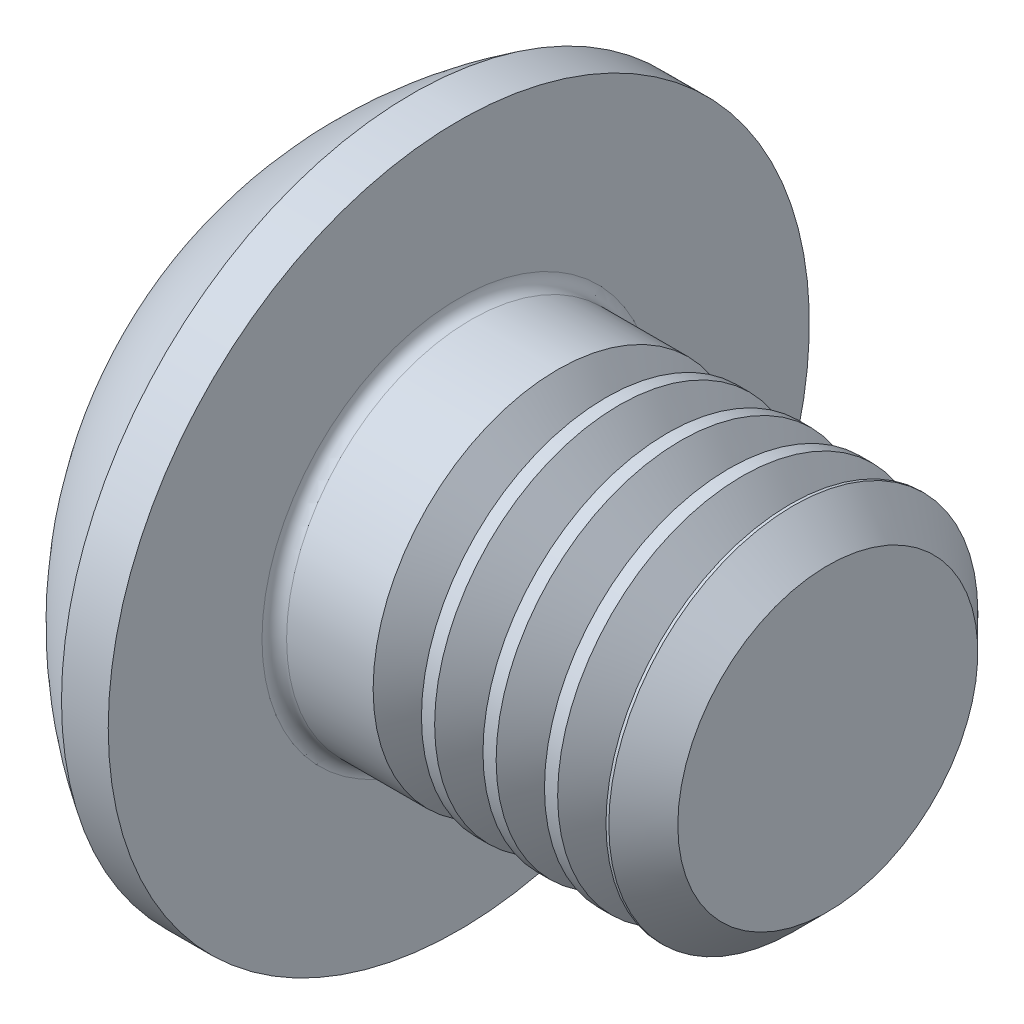
ISO-10303-21;
HEADER;
FILE_DESCRIPTION(('STEP AP214'),'2;1');
FILE_NAME('part.step','',(''),(''),'','','');
FILE_SCHEMA(('AUTOMOTIVE_DESIGN { 1 0 10303 214 1 1 1 1 }'));
ENDSEC;
DATA;
#1=APPLICATION_CONTEXT('core data for automotive mechanical design processes');
#2=APPLICATION_PROTOCOL_DEFINITION('international standard','automotive_design',2000,#1);
#3=PRODUCT_CONTEXT('',#1,'mechanical');
#4=PRODUCT('Part','Part','',(#3));
#5=PRODUCT_RELATED_PRODUCT_CATEGORY('part','',(#4));
#6=PRODUCT_DEFINITION_FORMATION('','',#4);
#7=PRODUCT_DEFINITION_CONTEXT('part definition',#1,'design');
#8=PRODUCT_DEFINITION('design','',#6,#7);
#9=PRODUCT_DEFINITION_SHAPE('','',#8);
#10=(LENGTH_UNIT() NAMED_UNIT(*) SI_UNIT(.MILLI.,.METRE.));
#11=(NAMED_UNIT(*) PLANE_ANGLE_UNIT() SI_UNIT($,.RADIAN.));
#12=(NAMED_UNIT(*) SI_UNIT($,.STERADIAN.) SOLID_ANGLE_UNIT());
#13=UNCERTAINTY_MEASURE_WITH_UNIT(LENGTH_MEASURE(1.E-05),#10,'distance_accuracy_value','');
#14=(GEOMETRIC_REPRESENTATION_CONTEXT(3) GLOBAL_UNCERTAINTY_ASSIGNED_CONTEXT((#13)) GLOBAL_UNIT_ASSIGNED_CONTEXT((#10,
#11,#12)) REPRESENTATION_CONTEXT('',''));
#15=CARTESIAN_POINT('',(0.,0.,0.));
#16=DIRECTION('',(0.,0.,1.));
#17=DIRECTION('',(1.,0.,0.));
#18=AXIS2_PLACEMENT_3D('',#15,#16,#17);
#19=CARTESIAN_POINT('',(0.,0.,0.));
#20=DIRECTION('',(-1.,0.,0.));
#21=DIRECTION('',(0.,0.,1.));
#22=AXIS2_PLACEMENT_3D('',#19,#20,#21);
#23=PLANE('',#22);
#24=CARTESIAN_POINT('',(0.,0.,0.));
#25=DIRECTION('',(-1.,0.,0.));
#26=DIRECTION('',(0.,0.,1.));
#27=AXIS2_PLACEMENT_3D('',#24,#25,#26);
#28=CIRCLE('',#27,1.425);
#29=CARTESIAN_POINT('',(0.,0.,1.425));
#30=VERTEX_POINT('',#29);
#31=EDGE_CURVE('E153',#30,#30,#28,.T.);
#32=ORIENTED_EDGE('',*,*,#31,.T.);
#33=EDGE_LOOP('',(#32));
#34=FACE_BOUND('',#33,.T.);
#35=DIRECTION('',(0.,-1.,0.));
#36=VECTOR('',#35,1.);
#37=CARTESIAN_POINT('',(0.,-0.577350269189625,0.999999999999998));
#38=LINE('',#37,#36);
#39=CARTESIAN_POINT('',(0.,0.577350269189628,1.));
#40=VERTEX_POINT('',#39);
#41=CARTESIAN_POINT('',(0.,-0.577350269189625,0.999999999999998));
#42=VERTEX_POINT('',#41);
#43=EDGE_CURVE('E48',#40,#42,#38,.T.);
#44=ORIENTED_EDGE('',*,*,#43,.T.);
#45=DIRECTION('',(0.,-0.499999999999999,-0.866025403784439));
#46=VECTOR('',#45,1.);
#47=CARTESIAN_POINT('',(0.,-1.15470053837925,0.));
#48=LINE('',#47,#46);
#49=CARTESIAN_POINT('',(0.,-1.15470053837925,0.));
#50=VERTEX_POINT('',#49);
#51=EDGE_CURVE('E298',#42,#50,#48,.T.);
#52=ORIENTED_EDGE('',*,*,#51,.T.);
#53=DIRECTION('',(0.,0.499999999999997,-0.86602540378444));
#54=VECTOR('',#53,1.);
#55=CARTESIAN_POINT('',(0.,-0.577350269189626,-1.));
#56=LINE('',#55,#54);
#57=CARTESIAN_POINT('',(0.,-0.577350269189626,-1.));
#58=VERTEX_POINT('',#57);
#59=EDGE_CURVE('E128',#50,#58,#56,.T.);
#60=ORIENTED_EDGE('',*,*,#59,.T.);
#61=DIRECTION('',(0.,1.,0.));
#62=VECTOR('',#61,1.);
#63=CARTESIAN_POINT('',(0.,0.577350269189628,-1.));
#64=LINE('',#63,#62);
#65=CARTESIAN_POINT('',(0.,0.577350269189628,-1.));
#66=VERTEX_POINT('',#65);
#67=EDGE_CURVE('E318',#58,#66,#64,.T.);
#68=ORIENTED_EDGE('',*,*,#67,.T.);
#69=DIRECTION('',(0.,0.499999999999999,0.866025403784439));
#70=VECTOR('',#69,1.);
#71=CARTESIAN_POINT('',(0.,1.15470053837925,0.));
#72=LINE('',#71,#70);
#73=CARTESIAN_POINT('',(0.,1.15470053837925,0.));
#74=VERTEX_POINT('',#73);
#75=EDGE_CURVE('E320',#66,#74,#72,.T.);
#76=ORIENTED_EDGE('',*,*,#75,.T.);
#77=DIRECTION('',(0.,-0.499999999999998,0.866025403784439));
#78=VECTOR('',#77,1.);
#79=CARTESIAN_POINT('',(0.,0.577350269189628,1.));
#80=LINE('',#79,#78);
#81=EDGE_CURVE('E322',#74,#40,#80,.T.);
#82=ORIENTED_EDGE('',*,*,#81,.T.);
#83=EDGE_LOOP('',(#44,#52,#60,#68,#76,#82));
#84=FACE_BOUND('',#83,.T.);
#85=ADVANCED_FACE('F33',(#34,#84),#23,.T.);
#86=CARTESIAN_POINT('',(3.03337598425198,0.,0.));
#87=DIRECTION('',(-1.,0.,0.));
#88=DIRECTION('',(0.,1.,0.));
#89=AXIS2_PLACEMENT_3D('',#86,#87,#88);
#90=SPHERICAL_SURFACE('',#89,3.35141684393879);
#91=CARTESIAN_POINT('',(1.27,0.,0.));
#92=DIRECTION('',(-1.,0.,0.));
#93=DIRECTION('',(0.,0.,1.));
#94=AXIS2_PLACEMENT_3D('',#91,#92,#93);
#95=CIRCLE('',#94,2.85);
#96=CARTESIAN_POINT('',(1.27,0.,2.85));
#97=VERTEX_POINT('',#96);
#98=EDGE_CURVE('E150',#97,#97,#95,.T.);
#99=ORIENTED_EDGE('',*,*,#98,.T.);
#100=EDGE_LOOP('',(#99));
#101=FACE_BOUND('',#100,.T.);
#102=ORIENTED_EDGE('',*,*,#31,.F.);
#103=EDGE_LOOP('',(#102));
#104=FACE_BOUND('',#103,.T.);
#105=ADVANCED_FACE('F175',(#101,#104),#90,.T.);
#106=CARTESIAN_POINT('',(0.,0.,0.));
#107=DIRECTION('',(-1.,0.,0.));
#108=DIRECTION('',(0.,0.,1.));
#109=AXIS2_PLACEMENT_3D('',#106,#107,#108);
#110=CYLINDRICAL_SURFACE('',#109,2.85);
#111=ORIENTED_EDGE('',*,*,#98,.F.);
#112=EDGE_LOOP('',(#111));
#113=FACE_BOUND('',#112,.T.);
#114=CARTESIAN_POINT('',(1.65,0.,0.));
#115=DIRECTION('',(-1.,0.,0.));
#116=DIRECTION('',(0.,0.,1.));
#117=AXIS2_PLACEMENT_3D('',#114,#115,#116);
#118=CIRCLE('',#117,2.85);
#119=CARTESIAN_POINT('',(1.65,0.,2.85));
#120=VERTEX_POINT('',#119);
#121=EDGE_CURVE('E147',#120,#120,#118,.T.);
#122=ORIENTED_EDGE('',*,*,#121,.T.);
#123=EDGE_LOOP('',(#122));
#124=FACE_BOUND('',#123,.T.);
#125=ADVANCED_FACE('F180',(#113,#124),#110,.T.);
#126=CARTESIAN_POINT('',(1.65,1.49999999999999,0.));
#127=DIRECTION('',(-1.,0.,0.));
#128=DIRECTION('',(0.,0.,1.));
#129=AXIS2_PLACEMENT_3D('',#126,#127,#128);
#130=PLANE('',#129);
#131=CARTESIAN_POINT('',(1.65,0.,0.));
#132=DIRECTION('',(-1.,0.,0.));
#133=DIRECTION('',(0.,0.,1.));
#134=AXIS2_PLACEMENT_3D('',#131,#132,#133);
#135=CIRCLE('',#134,1.6);
#136=CARTESIAN_POINT('',(1.65,0.,1.6));
#137=VERTEX_POINT('',#136);
#138=EDGE_CURVE('E41',#137,#137,#135,.T.);
#139=ORIENTED_EDGE('',*,*,#138,.T.);
#140=EDGE_LOOP('',(#139));
#141=FACE_BOUND('',#140,.T.);
#142=ORIENTED_EDGE('',*,*,#121,.F.);
#143=EDGE_LOOP('',(#142));
#144=FACE_BOUND('',#143,.T.);
#145=ADVANCED_FACE('F158',(#141,#144),#130,.F.);
#146=CARTESIAN_POINT('',(0.,0.,0.));
#147=DIRECTION('',(-1.,0.,0.));
#148=DIRECTION('',(0.,0.,1.));
#149=AXIS2_PLACEMENT_3D('',#146,#147,#148);
#150=CYLINDRICAL_SURFACE('',#149,1.5);
#151=CARTESIAN_POINT('',(2.45359178553217,0.,0.));
#152=DIRECTION('',(-1.,0.,0.));
#153=DIRECTION('',(0.,-1.,0.));
#154=AXIS2_PLACEMENT_3D('',#151,#152,#153);
#155=CIRCLE('',#154,1.5);
#156=CARTESIAN_POINT('',(2.45359178553217,-1.5,0.));
#157=VERTEX_POINT('',#156);
#158=EDGE_CURVE('E293',#157,#157,#155,.T.);
#159=ORIENTED_EDGE('',*,*,#158,.T.);
#160=EDGE_LOOP('',(#159));
#161=FACE_BOUND('',#160,.T.);
#162=CARTESIAN_POINT('',(1.75,0.,0.));
#163=DIRECTION('',(-1.,0.,0.));
#164=DIRECTION('',(0.,0.,1.));
#165=AXIS2_PLACEMENT_3D('',#162,#163,#164);
#166=CIRCLE('',#165,1.5);
#167=CARTESIAN_POINT('',(1.75,0.,1.5));
#168=VERTEX_POINT('',#167);
#169=EDGE_CURVE('E11',#168,#168,#166,.F.);
#170=ORIENTED_EDGE('',*,*,#169,.T.);
#171=EDGE_LOOP('',(#170));
#172=FACE_BOUND('',#171,.T.);
#173=ADVANCED_FACE('F162',(#161,#172),#150,.T.);
#174=CARTESIAN_POINT('',(1.75,0.,0.));
#175=DIRECTION('',(-1.,0.,0.));
#176=DIRECTION('',(0.,0.,1.));
#177=AXIS2_PLACEMENT_3D('',#174,#175,#176);
#178=TOROIDAL_SURFACE('',#177,1.6,0.1);
#179=ORIENTED_EDGE('',*,*,#169,.F.);
#180=EDGE_LOOP('',(#179));
#181=FACE_BOUND('',#180,.T.);
#182=ORIENTED_EDGE('',*,*,#138,.F.);
#183=EDGE_LOOP('',(#182));
#184=FACE_BOUND('',#183,.T.);
#185=ADVANCED_FACE('F35',(#181,#184),#178,.F.);
#186=CARTESIAN_POINT('',(1.04,-1.15470053837925,0.));
#187=DIRECTION('',(0.,0.866025403784439,-0.499999999999999));
#188=DIRECTION('',(0.,0.499999999999999,0.866025403784439));
#189=AXIS2_PLACEMENT_3D('',#186,#187,#188);
#190=PLANE('',#189);
#191=DIRECTION('',(0.,-0.499999999999999,-0.866025403784439));
#192=VECTOR('',#191,1.);
#193=CARTESIAN_POINT('',(1.04,-1.15470053837925,0.));
#194=LINE('',#193,#192);
#195=CARTESIAN_POINT('',(1.04,-0.577350269189625,0.999999999999998));
#196=VERTEX_POINT('',#195);
#197=CARTESIAN_POINT('',(1.04,-0.866025403784437,0.499999999999998));
#198=VERTEX_POINT('',#197);
#199=EDGE_CURVE('E114',#196,#198,#194,.T.);
#200=ORIENTED_EDGE('',*,*,#199,.T.);
#201=CARTESIAN_POINT('',(1.04,-1.15470053837925,0.));
#202=VERTEX_POINT('',#201);
#203=EDGE_CURVE('E109',#198,#202,#194,.T.);
#204=ORIENTED_EDGE('',*,*,#203,.T.);
#205=DIRECTION('',(-1.,0.,0.));
#206=VECTOR('',#205,1.);
#207=CARTESIAN_POINT('',(1.04,-1.15470053837925,0.));
#208=LINE('',#207,#206);
#209=EDGE_CURVE('E111',#202,#50,#208,.T.);
#210=ORIENTED_EDGE('',*,*,#209,.T.);
#211=ORIENTED_EDGE('',*,*,#51,.F.);
#212=DIRECTION('',(-1.,0.,0.));
#213=VECTOR('',#212,1.);
#214=CARTESIAN_POINT('',(1.04,-0.577350269189625,0.999999999999998));
#215=LINE('',#214,#213);
#216=EDGE_CURVE('E315',#196,#42,#215,.T.);
#217=ORIENTED_EDGE('',*,*,#216,.F.);
#218=EDGE_LOOP('',(#200,#204,#210,#211,#217));
#219=FACE_BOUND('',#218,.T.);
#220=ADVANCED_FACE('F110',(#219),#190,.T.);
#221=CARTESIAN_POINT('',(1.04,-0.577350269189626,-1.));
#222=DIRECTION('',(0.,0.86602540378444,0.499999999999998));
#223=DIRECTION('',(0.,-0.499999999999998,0.86602540378444));
#224=AXIS2_PLACEMENT_3D('',#221,#222,#223);
#225=PLANE('',#224);
#226=DIRECTION('',(0.,0.499999999999997,-0.86602540378444));
#227=VECTOR('',#226,1.);
#228=CARTESIAN_POINT('',(1.04,-0.577350269189626,-1.));
#229=LINE('',#228,#227);
#230=CARTESIAN_POINT('',(1.04,-0.86602540378444,-0.499999999999997));
#231=VERTEX_POINT('',#230);
#232=EDGE_CURVE('E56',#202,#231,#229,.T.);
#233=ORIENTED_EDGE('',*,*,#232,.T.);
#234=CARTESIAN_POINT('',(1.04,-0.577350269189626,-1.));
#235=VERTEX_POINT('',#234);
#236=EDGE_CURVE('E123',#231,#235,#229,.T.);
#237=ORIENTED_EDGE('',*,*,#236,.T.);
#238=DIRECTION('',(-1.,0.,0.));
#239=VECTOR('',#238,1.);
#240=CARTESIAN_POINT('',(1.04,-0.577350269189626,-1.));
#241=LINE('',#240,#239);
#242=EDGE_CURVE('E130',#235,#58,#241,.T.);
#243=ORIENTED_EDGE('',*,*,#242,.T.);
#244=ORIENTED_EDGE('',*,*,#59,.F.);
#245=ORIENTED_EDGE('',*,*,#209,.F.);
#246=EDGE_LOOP('',(#233,#237,#243,#244,#245));
#247=FACE_BOUND('',#246,.T.);
#248=ADVANCED_FACE('F126',(#247),#225,.T.);
#249=CARTESIAN_POINT('',(1.04,0.577350269189628,-1.));
#250=DIRECTION('',(0.,0.,1.));
#251=DIRECTION('',(1.,0.,0.));
#252=AXIS2_PLACEMENT_3D('',#249,#250,#251);
#253=PLANE('',#252);
#254=DIRECTION('',(0.,1.,0.));
#255=VECTOR('',#254,1.);
#256=CARTESIAN_POINT('',(1.04,0.577350269189628,-1.));
#257=LINE('',#256,#255);
#258=CARTESIAN_POINT('',(1.04,0.,-1.));
#259=VERTEX_POINT('',#258);
#260=EDGE_CURVE('E300',#235,#259,#257,.T.);
#261=ORIENTED_EDGE('',*,*,#260,.T.);
#262=CARTESIAN_POINT('',(1.04,0.577350269189628,-1.));
#263=VERTEX_POINT('',#262);
#264=EDGE_CURVE('E122',#259,#263,#257,.T.);
#265=ORIENTED_EDGE('',*,*,#264,.T.);
#266=DIRECTION('',(-1.,0.,0.));
#267=VECTOR('',#266,1.);
#268=CARTESIAN_POINT('',(1.04,0.577350269189628,-1.));
#269=LINE('',#268,#267);
#270=EDGE_CURVE('E135',#263,#66,#269,.T.);
#271=ORIENTED_EDGE('',*,*,#270,.T.);
#272=ORIENTED_EDGE('',*,*,#67,.F.);
#273=ORIENTED_EDGE('',*,*,#242,.F.);
#274=EDGE_LOOP('',(#261,#265,#271,#272,#273));
#275=FACE_BOUND('',#274,.T.);
#276=ADVANCED_FACE('F206',(#275),#253,.T.);
#277=CARTESIAN_POINT('',(1.04,1.15470053837925,0.));
#278=DIRECTION('',(0.,-0.86602540378444,0.499999999999999));
#279=DIRECTION('',(0.,-0.499999999999999,-0.866025403784439));
#280=AXIS2_PLACEMENT_3D('',#277,#278,#279);
#281=PLANE('',#280);
#282=DIRECTION('',(0.,0.499999999999999,0.866025403784439));
#283=VECTOR('',#282,1.);
#284=CARTESIAN_POINT('',(1.04,1.15470053837925,0.));
#285=LINE('',#284,#283);
#286=CARTESIAN_POINT('',(1.04,0.86602540378444,-0.499999999999999));
#287=VERTEX_POINT('',#286);
#288=EDGE_CURVE('E304',#263,#287,#285,.T.);
#289=ORIENTED_EDGE('',*,*,#288,.T.);
#290=CARTESIAN_POINT('',(1.04,1.15470053837925,0.));
#291=VERTEX_POINT('',#290);
#292=EDGE_CURVE('E303',#287,#291,#285,.T.);
#293=ORIENTED_EDGE('',*,*,#292,.T.);
#294=DIRECTION('',(-1.,0.,0.));
#295=VECTOR('',#294,1.);
#296=CARTESIAN_POINT('',(1.04,1.15470053837925,0.));
#297=LINE('',#296,#295);
#298=EDGE_CURVE('E330',#291,#74,#297,.T.);
#299=ORIENTED_EDGE('',*,*,#298,.T.);
#300=ORIENTED_EDGE('',*,*,#75,.F.);
#301=ORIENTED_EDGE('',*,*,#270,.F.);
#302=EDGE_LOOP('',(#289,#293,#299,#300,#301));
#303=FACE_BOUND('',#302,.T.);
#304=ADVANCED_FACE('F209',(#303),#281,.T.);
#305=CARTESIAN_POINT('',(1.04,0.577350269189628,1.));
#306=DIRECTION('',(0.,-0.86602540378444,-0.499999999999998));
#307=DIRECTION('',(0.,0.499999999999998,-0.86602540378444));
#308=AXIS2_PLACEMENT_3D('',#305,#306,#307);
#309=PLANE('',#308);
#310=DIRECTION('',(0.,-0.499999999999998,0.866025403784439));
#311=VECTOR('',#310,1.);
#312=CARTESIAN_POINT('',(1.04,0.577350269189628,1.));
#313=LINE('',#312,#311);
#314=CARTESIAN_POINT('',(1.04,0.86602540378444,0.499999999999999));
#315=VERTEX_POINT('',#314);
#316=EDGE_CURVE('E308',#291,#315,#313,.T.);
#317=ORIENTED_EDGE('',*,*,#316,.T.);
#318=CARTESIAN_POINT('',(1.04,0.577350269189628,1.));
#319=VERTEX_POINT('',#318);
#320=EDGE_CURVE('E307',#315,#319,#313,.T.);
#321=ORIENTED_EDGE('',*,*,#320,.T.);
#322=DIRECTION('',(-1.,0.,0.));
#323=VECTOR('',#322,1.);
#324=CARTESIAN_POINT('',(1.04,0.577350269189628,1.));
#325=LINE('',#324,#323);
#326=EDGE_CURVE('E327',#319,#40,#325,.T.);
#327=ORIENTED_EDGE('',*,*,#326,.T.);
#328=ORIENTED_EDGE('',*,*,#81,.F.);
#329=ORIENTED_EDGE('',*,*,#298,.F.);
#330=EDGE_LOOP('',(#317,#321,#327,#328,#329));
#331=FACE_BOUND('',#330,.T.);
#332=ADVANCED_FACE('F213',(#331),#309,.T.);
#333=CARTESIAN_POINT('',(1.04,-0.577350269189625,0.999999999999998));
#334=DIRECTION('',(0.,0.,-1.));
#335=DIRECTION('',(0.,1.,0.));
#336=AXIS2_PLACEMENT_3D('',#333,#334,#335);
#337=PLANE('',#336);
#338=DIRECTION('',(0.,-1.,0.));
#339=VECTOR('',#338,1.);
#340=CARTESIAN_POINT('',(1.04,-0.577350269189625,0.999999999999998));
#341=LINE('',#340,#339);
#342=CARTESIAN_POINT('',(1.04,0.,1.));
#343=VERTEX_POINT('',#342);
#344=EDGE_CURVE('E312',#319,#343,#341,.T.);
#345=ORIENTED_EDGE('',*,*,#344,.T.);
#346=EDGE_CURVE('E311',#343,#196,#341,.T.);
#347=ORIENTED_EDGE('',*,*,#346,.T.);
#348=ORIENTED_EDGE('',*,*,#216,.T.);
#349=ORIENTED_EDGE('',*,*,#43,.F.);
#350=ORIENTED_EDGE('',*,*,#326,.F.);
#351=EDGE_LOOP('',(#345,#347,#348,#349,#350));
#352=FACE_BOUND('',#351,.T.);
#353=ADVANCED_FACE('F217',(#352),#337,.T.);
#354=CARTESIAN_POINT('',(1.04,-1.73205080756887,-1.));
#355=DIRECTION('',(1.,0.,0.));
#356=DIRECTION('',(0.,0.,-1.));
#357=AXIS2_PLACEMENT_3D('',#354,#355,#356);
#358=PLANE('',#357);
#359=CARTESIAN_POINT('',(1.04,0.,0.));
#360=DIRECTION('',(-1.,0.,0.));
#361=DIRECTION('',(0.,0.,1.));
#362=AXIS2_PLACEMENT_3D('',#359,#360,#361);
#363=CIRCLE('',#362,1.);
#364=EDGE_CURVE('E344',#287,#259,#363,.T.);
#365=ORIENTED_EDGE('',*,*,#364,.F.);
#366=ORIENTED_EDGE('',*,*,#288,.F.);
#367=ORIENTED_EDGE('',*,*,#264,.F.);
#368=EDGE_LOOP('',(#365,#366,#367));
#369=FACE_BOUND('',#368,.T.);
#370=ADVANCED_FACE('F221',(#369),#358,.F.);
#371=EDGE_CURVE('E141',#315,#287,#363,.T.);
#372=ORIENTED_EDGE('',*,*,#371,.F.);
#373=ORIENTED_EDGE('',*,*,#316,.F.);
#374=ORIENTED_EDGE('',*,*,#292,.F.);
#375=EDGE_LOOP('',(#372,#373,#374));
#376=FACE_BOUND('',#375,.T.);
#377=ADVANCED_FACE('F352',(#376),#358,.F.);
#378=EDGE_CURVE('E134',#343,#315,#363,.T.);
#379=ORIENTED_EDGE('',*,*,#378,.F.);
#380=ORIENTED_EDGE('',*,*,#344,.F.);
#381=ORIENTED_EDGE('',*,*,#320,.F.);
#382=EDGE_LOOP('',(#379,#380,#381));
#383=FACE_BOUND('',#382,.T.);
#384=ADVANCED_FACE('F355',(#383),#358,.F.);
#385=EDGE_CURVE('E129',#198,#343,#363,.T.);
#386=ORIENTED_EDGE('',*,*,#385,.F.);
#387=ORIENTED_EDGE('',*,*,#199,.F.);
#388=ORIENTED_EDGE('',*,*,#346,.F.);
#389=EDGE_LOOP('',(#386,#387,#388));
#390=FACE_BOUND('',#389,.T.);
#391=ADVANCED_FACE('F359',(#390),#358,.F.);
#392=EDGE_CURVE('E120',#231,#198,#363,.T.);
#393=ORIENTED_EDGE('',*,*,#392,.F.);
#394=ORIENTED_EDGE('',*,*,#232,.F.);
#395=ORIENTED_EDGE('',*,*,#203,.F.);
#396=EDGE_LOOP('',(#393,#394,#395));
#397=FACE_BOUND('',#396,.T.);
#398=ADVANCED_FACE('F119',(#397),#358,.F.);
#399=EDGE_CURVE('E343',#259,#231,#363,.T.);
#400=ORIENTED_EDGE('',*,*,#399,.F.);
#401=ORIENTED_EDGE('',*,*,#260,.F.);
#402=ORIENTED_EDGE('',*,*,#236,.F.);
#403=EDGE_LOOP('',(#400,#401,#402));
#404=FACE_BOUND('',#403,.T.);
#405=ADVANCED_FACE('F201',(#404),#358,.F.);
#406=CARTESIAN_POINT('',(1.61735026918963,0.,0.));
#407=DIRECTION('',(-1.,0.,0.));
#408=DIRECTION('',(0.,0.,1.));
#409=AXIS2_PLACEMENT_3D('',#406,#407,#408);
#410=CONICAL_SURFACE('',#409,0.,1.04719755119659);
#411=ORIENTED_EDGE('',*,*,#378,.T.);
#412=ORIENTED_EDGE('',*,*,#371,.T.);
#413=ORIENTED_EDGE('',*,*,#364,.T.);
#414=ORIENTED_EDGE('',*,*,#399,.T.);
#415=ORIENTED_EDGE('',*,*,#392,.T.);
#416=ORIENTED_EDGE('',*,*,#385,.T.);
#417=EDGE_LOOP('',(#411,#412,#413,#414,#415,#416));
#418=FACE_BOUND('',#417,.T.);
#419=CARTESIAN_POINT('',(1.61735026918963,0.,0.));
#420=VERTEX_POINT('',#419);
#421=VERTEX_LOOP('',#420);
#422=FACE_BOUND('',#421,.T.);
#423=ADVANCED_FACE('F198',(#418,#422),#410,.F.);
#424=CARTESIAN_POINT('',(2.84640821446782,0.,0.));
#425=DIRECTION('',(1.,0.,0.));
#426=DIRECTION('',(0.,1.,0.));
#427=AXIS2_PLACEMENT_3D('',#424,#425,#426);
#428=CONICAL_SURFACE('',#427,1.5,0.959931088596878);
#429=CARTESIAN_POINT('',(2.65,0.,0.));
#430=DIRECTION('',(-1.,0.,0.));
#431=DIRECTION('',(0.,-1.,0.));
#432=AXIS2_PLACEMENT_3D('',#429,#430,#431);
#433=CIRCLE('',#432,1.2195);
#434=CARTESIAN_POINT('',(2.65,-1.2195,0.));
#435=VERTEX_POINT('',#434);
#436=EDGE_CURVE('E290',#435,#435,#433,.T.);
#437=ORIENTED_EDGE('',*,*,#436,.F.);
#438=EDGE_LOOP('',(#437));
#439=FACE_BOUND('',#438,.T.);
#440=CARTESIAN_POINT('',(2.84640821446782,0.,0.));
#441=DIRECTION('',(-1.,0.,0.));
#442=DIRECTION('',(0.,-1.,0.));
#443=AXIS2_PLACEMENT_3D('',#440,#441,#442);
#444=CIRCLE('',#443,1.5);
#445=CARTESIAN_POINT('',(2.84640821446782,-1.5,0.));
#446=VERTEX_POINT('',#445);
#447=EDGE_CURVE('E296',#446,#446,#444,.T.);
#448=ORIENTED_EDGE('',*,*,#447,.T.);
#449=EDGE_LOOP('',(#448));
#450=FACE_BOUND('',#449,.T.);
#451=ADVANCED_FACE('F200',(#439,#450),#428,.T.);
#452=CARTESIAN_POINT('',(2.65,0.,0.));
#453=DIRECTION('',(-1.,0.,0.));
#454=DIRECTION('',(0.,-1.,0.));
#455=AXIS2_PLACEMENT_3D('',#452,#453,#454);
#456=CONICAL_SURFACE('',#455,1.2195,0.959931088596875);
#457=ORIENTED_EDGE('',*,*,#158,.F.);
#458=EDGE_LOOP('',(#457));
#459=FACE_BOUND('',#458,.T.);
#460=ORIENTED_EDGE('',*,*,#436,.T.);
#461=EDGE_LOOP('',(#460));
#462=FACE_BOUND('',#461,.T.);
#463=ADVANCED_FACE('F228',(#459,#462),#456,.T.);
#464=CARTESIAN_POINT('',(2.95359178553217,0.,0.));
#465=DIRECTION('',(-1.,0.,0.));
#466=DIRECTION('',(0.,-1.,0.));
#467=AXIS2_PLACEMENT_3D('',#464,#465,#466);
#468=CIRCLE('',#467,1.5);
#469=CARTESIAN_POINT('',(2.95359178553217,-1.5,0.));
#470=VERTEX_POINT('',#469);
#471=EDGE_CURVE('E284',#470,#470,#468,.T.);
#472=ORIENTED_EDGE('',*,*,#471,.T.);
#473=EDGE_LOOP('',(#472));
#474=FACE_BOUND('',#473,.T.);
#475=ORIENTED_EDGE('',*,*,#447,.F.);
#476=EDGE_LOOP('',(#475));
#477=FACE_BOUND('',#476,.T.);
#478=ADVANCED_FACE('F172',(#474,#477),#150,.T.);
#479=CARTESIAN_POINT('',(3.34640821446782,0.,0.));
#480=DIRECTION('',(1.,0.,0.));
#481=DIRECTION('',(0.,1.,0.));
#482=AXIS2_PLACEMENT_3D('',#479,#480,#481);
#483=CONICAL_SURFACE('',#482,1.5,0.959931088596878);
#484=CARTESIAN_POINT('',(3.15,0.,0.));
#485=DIRECTION('',(-1.,0.,0.));
#486=DIRECTION('',(0.,-1.,0.));
#487=AXIS2_PLACEMENT_3D('',#484,#485,#486);
#488=CIRCLE('',#487,1.2195);
#489=CARTESIAN_POINT('',(3.15,-1.2195,0.));
#490=VERTEX_POINT('',#489);
#491=EDGE_CURVE('E281',#490,#490,#488,.T.);
#492=ORIENTED_EDGE('',*,*,#491,.F.);
#493=EDGE_LOOP('',(#492));
#494=FACE_BOUND('',#493,.T.);
#495=CARTESIAN_POINT('',(3.34640821446782,0.,0.));
#496=DIRECTION('',(-1.,0.,0.));
#497=DIRECTION('',(0.,-1.,0.));
#498=AXIS2_PLACEMENT_3D('',#495,#496,#497);
#499=CIRCLE('',#498,1.5);
#500=CARTESIAN_POINT('',(3.34640821446782,-1.5,0.));
#501=VERTEX_POINT('',#500);
#502=EDGE_CURVE('E287',#501,#501,#499,.T.);
#503=ORIENTED_EDGE('',*,*,#502,.T.);
#504=EDGE_LOOP('',(#503));
#505=FACE_BOUND('',#504,.T.);
#506=ADVANCED_FACE('F233',(#494,#505),#483,.T.);
#507=CARTESIAN_POINT('',(3.15,0.,0.));
#508=DIRECTION('',(-1.,0.,0.));
#509=DIRECTION('',(0.,-1.,0.));
#510=AXIS2_PLACEMENT_3D('',#507,#508,#509);
#511=CONICAL_SURFACE('',#510,1.2195,0.959931088596875);
#512=ORIENTED_EDGE('',*,*,#471,.F.);
#513=EDGE_LOOP('',(#512));
#514=FACE_BOUND('',#513,.T.);
#515=ORIENTED_EDGE('',*,*,#491,.T.);
#516=EDGE_LOOP('',(#515));
#517=FACE_BOUND('',#516,.T.);
#518=ADVANCED_FACE('F236',(#514,#517),#511,.T.);
#519=CARTESIAN_POINT('',(3.45359178553217,0.,0.));
#520=DIRECTION('',(-1.,0.,0.));
#521=DIRECTION('',(0.,-1.,0.));
#522=AXIS2_PLACEMENT_3D('',#519,#520,#521);
#523=CIRCLE('',#522,1.5);
#524=CARTESIAN_POINT('',(3.45359178553217,-1.5,0.));
#525=VERTEX_POINT('',#524);
#526=EDGE_CURVE('E275',#525,#525,#523,.T.);
#527=ORIENTED_EDGE('',*,*,#526,.T.);
#528=EDGE_LOOP('',(#527));
#529=FACE_BOUND('',#528,.T.);
#530=ORIENTED_EDGE('',*,*,#502,.F.);
#531=EDGE_LOOP('',(#530));
#532=FACE_BOUND('',#531,.T.);
#533=ADVANCED_FACE('F240',(#529,#532),#150,.T.);
#534=CARTESIAN_POINT('',(3.84640821446782,0.,0.));
#535=DIRECTION('',(1.,0.,0.));
#536=DIRECTION('',(0.,1.,0.));
#537=AXIS2_PLACEMENT_3D('',#534,#535,#536);
#538=CONICAL_SURFACE('',#537,1.5,0.959931088596878);
#539=CARTESIAN_POINT('',(3.65,0.,0.));
#540=DIRECTION('',(-1.,0.,0.));
#541=DIRECTION('',(0.,-1.,0.));
#542=AXIS2_PLACEMENT_3D('',#539,#540,#541);
#543=CIRCLE('',#542,1.2195);
#544=CARTESIAN_POINT('',(3.65,-1.2195,0.));
#545=VERTEX_POINT('',#544);
#546=EDGE_CURVE('E272',#545,#545,#543,.T.);
#547=ORIENTED_EDGE('',*,*,#546,.F.);
#548=EDGE_LOOP('',(#547));
#549=FACE_BOUND('',#548,.T.);
#550=CARTESIAN_POINT('',(3.84640821446782,0.,0.));
#551=DIRECTION('',(-1.,0.,0.));
#552=DIRECTION('',(0.,-1.,0.));
#553=AXIS2_PLACEMENT_3D('',#550,#551,#552);
#554=CIRCLE('',#553,1.5);
#555=CARTESIAN_POINT('',(3.84640821446782,-1.5,0.));
#556=VERTEX_POINT('',#555);
#557=EDGE_CURVE('E278',#556,#556,#554,.T.);
#558=ORIENTED_EDGE('',*,*,#557,.T.);
#559=EDGE_LOOP('',(#558));
#560=FACE_BOUND('',#559,.T.);
#561=ADVANCED_FACE('F242',(#549,#560),#538,.T.);
#562=CARTESIAN_POINT('',(3.65,0.,0.));
#563=DIRECTION('',(-1.,0.,0.));
#564=DIRECTION('',(0.,-1.,0.));
#565=AXIS2_PLACEMENT_3D('',#562,#563,#564);
#566=CONICAL_SURFACE('',#565,1.2195,0.959931088596875);
#567=ORIENTED_EDGE('',*,*,#526,.F.);
#568=EDGE_LOOP('',(#567));
#569=FACE_BOUND('',#568,.T.);
#570=ORIENTED_EDGE('',*,*,#546,.T.);
#571=EDGE_LOOP('',(#570));
#572=FACE_BOUND('',#571,.T.);
#573=ADVANCED_FACE('F245',(#569,#572),#566,.T.);
#574=CARTESIAN_POINT('',(3.95359178553217,0.,0.));
#575=DIRECTION('',(-1.,0.,0.));
#576=DIRECTION('',(0.,-1.,0.));
#577=AXIS2_PLACEMENT_3D('',#574,#575,#576);
#578=CIRCLE('',#577,1.5);
#579=CARTESIAN_POINT('',(3.95359178553217,-1.5,0.));
#580=VERTEX_POINT('',#579);
#581=EDGE_CURVE('E262',#580,#580,#578,.T.);
#582=ORIENTED_EDGE('',*,*,#581,.T.);
#583=EDGE_LOOP('',(#582));
#584=FACE_BOUND('',#583,.T.);
#585=ORIENTED_EDGE('',*,*,#557,.F.);
#586=EDGE_LOOP('',(#585));
#587=FACE_BOUND('',#586,.T.);
#588=ADVANCED_FACE('F249',(#584,#587),#150,.T.);
#589=CARTESIAN_POINT('',(4.34640821446782,0.,0.));
#590=DIRECTION('',(1.,0.,0.));
#591=DIRECTION('',(0.,1.,0.));
#592=AXIS2_PLACEMENT_3D('',#589,#590,#591);
#593=CONICAL_SURFACE('',#592,1.5,0.959931088596878);
#594=CARTESIAN_POINT('',(4.15,0.,0.));
#595=DIRECTION('',(-1.,0.,0.));
#596=DIRECTION('',(0.,-1.,0.));
#597=AXIS2_PLACEMENT_3D('',#594,#595,#596);
#598=CIRCLE('',#597,1.2195);
#599=CARTESIAN_POINT('',(4.15,-1.2195,0.));
#600=VERTEX_POINT('',#599);
#601=EDGE_CURVE('E265',#600,#600,#598,.T.);
#602=ORIENTED_EDGE('',*,*,#601,.F.);
#603=EDGE_LOOP('',(#602));
#604=FACE_BOUND('',#603,.T.);
#605=CARTESIAN_POINT('',(4.34640821446782,0.,0.));
#606=DIRECTION('',(-1.,0.,0.));
#607=DIRECTION('',(0.,-1.,0.));
#608=AXIS2_PLACEMENT_3D('',#605,#606,#607);
#609=CIRCLE('',#608,1.5);
#610=CARTESIAN_POINT('',(4.34640821446782,-1.5,0.));
#611=VERTEX_POINT('',#610);
#612=EDGE_CURVE('E267',#611,#611,#609,.T.);
#613=ORIENTED_EDGE('',*,*,#612,.T.);
#614=EDGE_LOOP('',(#613));
#615=FACE_BOUND('',#614,.T.);
#616=ADVANCED_FACE('F251',(#604,#615),#593,.T.);
#617=CARTESIAN_POINT('',(4.15,0.,0.));
#618=DIRECTION('',(-1.,0.,0.));
#619=DIRECTION('',(0.,-1.,0.));
#620=AXIS2_PLACEMENT_3D('',#617,#618,#619);
#621=CONICAL_SURFACE('',#620,1.2195,0.959931088596875);
#622=ORIENTED_EDGE('',*,*,#581,.F.);
#623=EDGE_LOOP('',(#622));
#624=FACE_BOUND('',#623,.T.);
#625=ORIENTED_EDGE('',*,*,#601,.T.);
#626=EDGE_LOOP('',(#625));
#627=FACE_BOUND('',#626,.T.);
#628=ADVANCED_FACE('F196',(#624,#627),#621,.T.);
#629=CARTESIAN_POINT('',(4.65,0.,0.));
#630=DIRECTION('',(-1.,0.,0.));
#631=DIRECTION('',(0.,0.,1.));
#632=AXIS2_PLACEMENT_3D('',#629,#630,#631);
#633=PLANE('',#632);
#634=CARTESIAN_POINT('',(4.65,0.,0.));
#635=DIRECTION('',(-1.,0.,0.));
#636=DIRECTION('',(0.,0.,1.));
#637=AXIS2_PLACEMENT_3D('',#634,#635,#636);
#638=CIRCLE('',#637,1.2195);
#639=CARTESIAN_POINT('',(4.65,0.,1.2195));
#640=VERTEX_POINT('',#639);
#641=EDGE_CURVE('E140',#640,#640,#638,.T.);
#642=ORIENTED_EDGE('',*,*,#641,.F.);
#643=EDGE_LOOP('',(#642));
#644=FACE_BOUND('',#643,.T.);
#645=ADVANCED_FACE('F192',(#644),#633,.F.);
#646=CARTESIAN_POINT('',(4.65,0.,0.));
#647=DIRECTION('',(-1.,0.,0.));
#648=DIRECTION('',(0.,0.,1.));
#649=AXIS2_PLACEMENT_3D('',#646,#647,#648);
#650=CONICAL_SURFACE('',#649,1.2195,0.785398163397449);
#651=CARTESIAN_POINT('',(4.3695,0.,0.));
#652=DIRECTION('',(-1.,0.,0.));
#653=DIRECTION('',(0.,0.,1.));
#654=AXIS2_PLACEMENT_3D('',#651,#652,#653);
#655=CIRCLE('',#654,1.5);
#656=CARTESIAN_POINT('',(4.3695,0.,1.5));
#657=VERTEX_POINT('',#656);
#658=EDGE_CURVE('E144',#657,#657,#655,.T.);
#659=ORIENTED_EDGE('',*,*,#658,.F.);
#660=EDGE_LOOP('',(#659));
#661=FACE_BOUND('',#660,.T.);
#662=ORIENTED_EDGE('',*,*,#641,.T.);
#663=EDGE_LOOP('',(#662));
#664=FACE_BOUND('',#663,.T.);
#665=ADVANCED_FACE('F189',(#661,#664),#650,.T.);
#666=ORIENTED_EDGE('',*,*,#612,.F.);
#667=EDGE_LOOP('',(#666));
#668=FACE_BOUND('',#667,.T.);
#669=ORIENTED_EDGE('',*,*,#658,.T.);
#670=EDGE_LOOP('',(#669));
#671=FACE_BOUND('',#670,.T.);
#672=ADVANCED_FACE('F171',(#668,#671),#150,.T.);
#673=CLOSED_SHELL('',(#85,#105,#125,#145,#173,#185,#220,#248,#276,#304,#332,#353,#370,#377,#384,
#391,#398,#405,#423,#451,#463,#478,#506,#518,#533,#561,#573,#588,#616,#628,#645,#665,#672));
#674=MANIFOLD_SOLID_BREP('B2',#673);
#675=ADVANCED_BREP_SHAPE_REPRESENTATION('',(#18,#674),#14);
#676=SHAPE_DEFINITION_REPRESENTATION(#9,#675);
ENDSEC;
END-ISO-10303-21;
